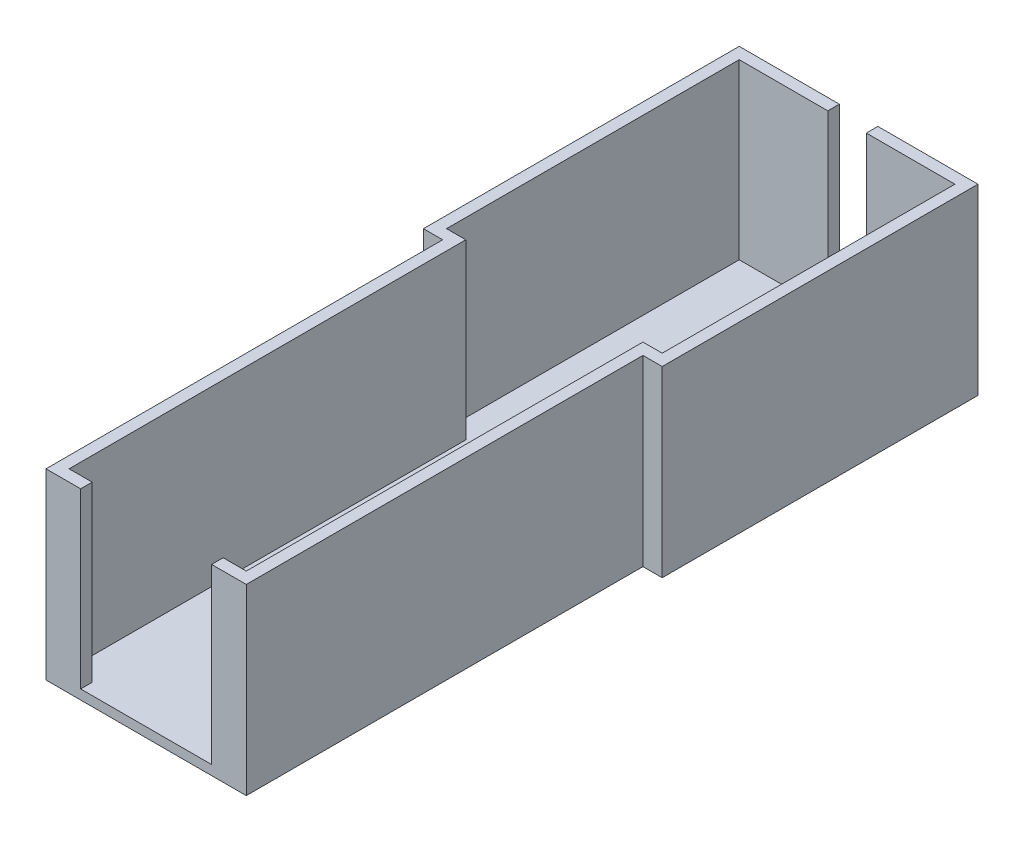
ISO-10303-21;
HEADER;
FILE_DESCRIPTION(('STEP AP214'),'2;1');
FILE_NAME('part.step','',(''),(''),'','','');
FILE_SCHEMA(('AUTOMOTIVE_DESIGN { 1 0 10303 214 1 1 1 1 }'));
ENDSEC;
DATA;
#1=APPLICATION_CONTEXT('core data for automotive mechanical design processes');
#2=APPLICATION_PROTOCOL_DEFINITION('international standard','automotive_design',2000,#1);
#3=PRODUCT_CONTEXT('',#1,'mechanical');
#4=PRODUCT('Part','Part','',(#3));
#5=PRODUCT_RELATED_PRODUCT_CATEGORY('part','',(#4));
#6=PRODUCT_DEFINITION_FORMATION('','',#4);
#7=PRODUCT_DEFINITION_CONTEXT('part definition',#1,'design');
#8=PRODUCT_DEFINITION('design','',#6,#7);
#9=PRODUCT_DEFINITION_SHAPE('','',#8);
#10=(LENGTH_UNIT() NAMED_UNIT(*) SI_UNIT(.MILLI.,.METRE.));
#11=(NAMED_UNIT(*) PLANE_ANGLE_UNIT() SI_UNIT($,.RADIAN.));
#12=(NAMED_UNIT(*) SI_UNIT($,.STERADIAN.) SOLID_ANGLE_UNIT());
#13=UNCERTAINTY_MEASURE_WITH_UNIT(LENGTH_MEASURE(1.E-05),#10,'distance_accuracy_value','');
#14=(GEOMETRIC_REPRESENTATION_CONTEXT(3) GLOBAL_UNCERTAINTY_ASSIGNED_CONTEXT((#13)) GLOBAL_UNIT_ASSIGNED_CONTEXT((#10,
#11,#12)) REPRESENTATION_CONTEXT('',''));
#15=CARTESIAN_POINT('',(0.,0.,0.));
#16=DIRECTION('',(0.,0.,1.));
#17=DIRECTION('',(1.,0.,0.));
#18=AXIS2_PLACEMENT_3D('',#15,#16,#17);
#19=CARTESIAN_POINT('',(0.,47.5,157.513513513514));
#20=DIRECTION('',(0.,0.,-1.));
#21=DIRECTION('',(-1.,0.,0.));
#22=AXIS2_PLACEMENT_3D('',#19,#20,#21);
#23=PLANE('',#22);
#24=DIRECTION('',(0.,1.,0.));
#25=VECTOR('',#24,1.);
#26=CARTESIAN_POINT('',(17.4054054054054,2.5,157.513513513514));
#27=LINE('',#26,#25);
#28=CARTESIAN_POINT('',(17.4054054054054,2.5,157.513513513514));
#29=VERTEX_POINT('',#28);
#30=CARTESIAN_POINT('',(17.4054054054054,47.5,157.513513513514));
#31=VERTEX_POINT('',#30);
#32=EDGE_CURVE('E462',#29,#31,#27,.T.);
#33=ORIENTED_EDGE('',*,*,#32,.T.);
#34=DIRECTION('',(1.,0.,0.));
#35=VECTOR('',#34,1.);
#36=CARTESIAN_POINT('',(0.,47.5,157.513513513514));
#37=LINE('',#36,#35);
#38=CARTESIAN_POINT('',(23.4054054054054,47.5,157.513513513514));
#39=VERTEX_POINT('',#38);
#40=EDGE_CURVE('E384',#31,#39,#37,.T.);
#41=ORIENTED_EDGE('',*,*,#40,.T.);
#42=DIRECTION('',(0.,-1.,0.));
#43=VECTOR('',#42,1.);
#44=CARTESIAN_POINT('',(23.4054054054054,47.5,157.513513513514));
#45=LINE('',#44,#43);
#46=CARTESIAN_POINT('',(23.4054054054054,2.5,157.513513513514));
#47=VERTEX_POINT('',#46);
#48=EDGE_CURVE('E271',#39,#47,#45,.T.);
#49=ORIENTED_EDGE('',*,*,#48,.T.);
#50=DIRECTION('',(1.,0.,0.));
#51=VECTOR('',#50,1.);
#52=CARTESIAN_POINT('',(0.,2.5,157.513513513514));
#53=LINE('',#52,#51);
#54=EDGE_CURVE('E413',#29,#47,#53,.T.);
#55=ORIENTED_EDGE('',*,*,#54,.F.);
#56=EDGE_LOOP('',(#33,#41,#49,#55));
#57=FACE_BOUND('',#56,.T.);
#58=ADVANCED_FACE('F41',(#57),#23,.T.);
#59=CARTESIAN_POINT('',(0.,47.5,-21.4864864864865));
#60=DIRECTION('',(0.,0.,-1.));
#61=DIRECTION('',(-1.,0.,0.));
#62=AXIS2_PLACEMENT_3D('',#59,#60,#61);
#63=PLANE('',#62);
#64=DIRECTION('',(1.,0.,0.));
#65=VECTOR('',#64,1.);
#66=CARTESIAN_POINT('',(0.,2.5,-21.4864864864865));
#67=LINE('',#66,#65);
#68=CARTESIAN_POINT('',(-27.5945945945946,2.5,-21.4864864864865));
#69=VERTEX_POINT('',#68);
#70=CARTESIAN_POINT('',(-4.59459459459459,2.5,-21.4864864864865));
#71=VERTEX_POINT('',#70);
#72=EDGE_CURVE('E227',#69,#71,#67,.T.);
#73=ORIENTED_EDGE('',*,*,#72,.T.);
#74=DIRECTION('',(0.,1.,0.));
#75=VECTOR('',#74,1.);
#76=CARTESIAN_POINT('',(-4.59459459459459,2.5,-21.4864864864865));
#77=LINE('',#76,#75);
#78=CARTESIAN_POINT('',(-4.59459459459459,47.5,-21.4864864864865));
#79=VERTEX_POINT('',#78);
#80=EDGE_CURVE('E220',#71,#79,#77,.T.);
#81=ORIENTED_EDGE('',*,*,#80,.T.);
#82=DIRECTION('',(1.,0.,0.));
#83=VECTOR('',#82,1.);
#84=CARTESIAN_POINT('',(0.,47.5,-21.4864864864865));
#85=LINE('',#84,#83);
#86=CARTESIAN_POINT('',(-27.5945945945946,47.5,-21.4864864864865));
#87=VERTEX_POINT('',#86);
#88=EDGE_CURVE('E400',#87,#79,#85,.T.);
#89=ORIENTED_EDGE('',*,*,#88,.F.);
#90=DIRECTION('',(0.,-1.,0.));
#91=VECTOR('',#90,1.);
#92=CARTESIAN_POINT('',(-27.5945945945946,47.5,-21.4864864864865));
#93=LINE('',#92,#91);
#94=EDGE_CURVE('E255',#87,#69,#93,.T.);
#95=ORIENTED_EDGE('',*,*,#94,.T.);
#96=EDGE_LOOP('',(#73,#81,#89,#95));
#97=FACE_BOUND('',#96,.T.);
#98=ADVANCED_FACE('F533',(#97),#63,.F.);
#99=CARTESIAN_POINT('',(0.,47.5,0.));
#100=DIRECTION('',(0.,1.,0.));
#101=DIRECTION('',(0.,0.,1.));
#102=AXIS2_PLACEMENT_3D('',#99,#100,#101);
#103=PLANE('',#102);
#104=DIRECTION('',(0.,0.,1.));
#105=VECTOR('',#104,1.);
#106=CARTESIAN_POINT('',(-4.59459459459459,47.5,-21.4864864864865));
#107=LINE('',#106,#105);
#108=CARTESIAN_POINT('',(-4.59459459459459,47.5,-24.4864864864865));
#109=VERTEX_POINT('',#108);
#110=EDGE_CURVE('E477',#109,#79,#107,.T.);
#111=ORIENTED_EDGE('',*,*,#110,.F.);
#112=DIRECTION('',(-1.,0.,0.));
#113=VECTOR('',#112,1.);
#114=CARTESIAN_POINT('',(0.,47.5,-24.4864864864865));
#115=LINE('',#114,#113);
#116=CARTESIAN_POINT('',(-30.5945945945946,47.5,-24.4864864864865));
#117=VERTEX_POINT('',#116);
#118=EDGE_CURVE('E354',#109,#117,#115,.T.);
#119=ORIENTED_EDGE('',*,*,#118,.T.);
#120=DIRECTION('',(0.,0.,1.));
#121=VECTOR('',#120,1.);
#122=CARTESIAN_POINT('',(-30.5945945945946,47.5,0.));
#123=LINE('',#122,#121);
#124=CARTESIAN_POINT('',(-30.5945945945946,47.5,57.5135135135135));
#125=VERTEX_POINT('',#124);
#126=EDGE_CURVE('E363',#117,#125,#123,.T.);
#127=ORIENTED_EDGE('',*,*,#126,.T.);
#128=DIRECTION('',(1.,0.,0.));
#129=VECTOR('',#128,1.);
#130=CARTESIAN_POINT('',(0.,47.5,57.5135135135135));
#131=LINE('',#130,#129);
#132=CARTESIAN_POINT('',(-25.5945945945946,47.5,57.5135135135135));
#133=VERTEX_POINT('',#132);
#134=EDGE_CURVE('E367',#125,#133,#131,.T.);
#135=ORIENTED_EDGE('',*,*,#134,.T.);
#136=DIRECTION('',(0.,0.,1.));
#137=VECTOR('',#136,1.);
#138=CARTESIAN_POINT('',(-25.5945945945946,47.5,0.));
#139=LINE('',#138,#137);
#140=CARTESIAN_POINT('',(-25.5945945945946,47.5,160.513513513514));
#141=VERTEX_POINT('',#140);
#142=EDGE_CURVE('E371',#133,#141,#139,.T.);
#143=ORIENTED_EDGE('',*,*,#142,.T.);
#144=DIRECTION('',(1.,0.,0.));
#145=VECTOR('',#144,1.);
#146=CARTESIAN_POINT('',(0.,47.5,160.513513513514));
#147=LINE('',#146,#145);
#148=CARTESIAN_POINT('',(-16.5945945945946,47.5,160.513513513514));
#149=VERTEX_POINT('',#148);
#150=EDGE_CURVE('E376',#141,#149,#147,.T.);
#151=ORIENTED_EDGE('',*,*,#150,.T.);
#152=DIRECTION('',(0.,0.,1.));
#153=VECTOR('',#152,1.);
#154=CARTESIAN_POINT('',(-16.5945945945946,47.5,160.513513513514));
#155=LINE('',#154,#153);
#156=CARTESIAN_POINT('',(-16.5945945945946,47.5,157.513513513514));
#157=VERTEX_POINT('',#156);
#158=EDGE_CURVE('E472',#157,#149,#155,.T.);
#159=ORIENTED_EDGE('',*,*,#158,.F.);
#160=CARTESIAN_POINT('',(-22.5945945945946,47.5,157.513513513514));
#161=VERTEX_POINT('',#160);
#162=EDGE_CURVE('E385',#161,#157,#37,.T.);
#163=ORIENTED_EDGE('',*,*,#162,.F.);
#164=DIRECTION('',(0.,0.,-1.));
#165=VECTOR('',#164,1.);
#166=CARTESIAN_POINT('',(-22.5945945945946,47.5,0.));
#167=LINE('',#166,#165);
#168=CARTESIAN_POINT('',(-22.5945945945946,47.5,54.5135135135135));
#169=VERTEX_POINT('',#168);
#170=EDGE_CURVE('E389',#161,#169,#167,.T.);
#171=ORIENTED_EDGE('',*,*,#170,.T.);
#172=DIRECTION('',(-1.,0.,0.));
#173=VECTOR('',#172,1.);
#174=CARTESIAN_POINT('',(0.,47.5,54.5135135135135));
#175=LINE('',#174,#173);
#176=CARTESIAN_POINT('',(-27.5945945945946,47.5,54.5135135135135));
#177=VERTEX_POINT('',#176);
#178=EDGE_CURVE('E393',#169,#177,#175,.T.);
#179=ORIENTED_EDGE('',*,*,#178,.T.);
#180=DIRECTION('',(0.,0.,1.));
#181=VECTOR('',#180,1.);
#182=CARTESIAN_POINT('',(-27.5945945945946,47.5,0.));
#183=LINE('',#182,#181);
#184=EDGE_CURVE('E396',#87,#177,#183,.T.);
#185=ORIENTED_EDGE('',*,*,#184,.F.);
#186=ORIENTED_EDGE('',*,*,#88,.T.);
#187=EDGE_LOOP('',(#111,#119,#127,#135,#143,#151,#159,#163,#171,#179,#185,#186));
#188=FACE_BOUND('',#187,.T.);
#189=ADVANCED_FACE('F435',(#188),#103,.T.);
#190=CARTESIAN_POINT('',(26.4054054054054,2.5,0.));
#191=DIRECTION('',(1.,0.,0.));
#192=DIRECTION('',(0.,0.,-1.));
#193=AXIS2_PLACEMENT_3D('',#190,#191,#192);
#194=PLANE('',#193);
#195=DIRECTION('',(0.,0.,1.));
#196=VECTOR('',#195,1.);
#197=CARTESIAN_POINT('',(26.4054054054054,0.,0.));
#198=LINE('',#197,#196);
#199=CARTESIAN_POINT('',(26.4054054054054,0.,57.5135135135135));
#200=VERTEX_POINT('',#199);
#201=CARTESIAN_POINT('',(26.4054054054054,0.,160.513513513514));
#202=VERTEX_POINT('',#201);
#203=EDGE_CURVE('E275',#200,#202,#198,.T.);
#204=ORIENTED_EDGE('',*,*,#203,.F.);
#205=DIRECTION('',(0.,-1.,0.));
#206=VECTOR('',#205,1.);
#207=CARTESIAN_POINT('',(26.4054054054054,2.5,57.5135135135135));
#208=LINE('',#207,#206);
#209=CARTESIAN_POINT('',(26.4054054054054,47.5,57.5135135135135));
#210=VERTEX_POINT('',#209);
#211=EDGE_CURVE('E11',#210,#200,#208,.T.);
#212=ORIENTED_EDGE('',*,*,#211,.F.);
#213=DIRECTION('',(0.,0.,-1.));
#214=VECTOR('',#213,1.);
#215=CARTESIAN_POINT('',(26.4054054054054,47.5,0.));
#216=LINE('',#215,#214);
#217=CARTESIAN_POINT('',(26.4054054054054,47.5,160.513513513514));
#218=VERTEX_POINT('',#217);
#219=EDGE_CURVE('E242',#218,#210,#216,.T.);
#220=ORIENTED_EDGE('',*,*,#219,.F.);
#221=DIRECTION('',(0.,-1.,0.));
#222=VECTOR('',#221,1.);
#223=CARTESIAN_POINT('',(26.4054054054054,2.5,160.513513513514));
#224=LINE('',#223,#222);
#225=EDGE_CURVE('E302',#218,#202,#224,.T.);
#226=ORIENTED_EDGE('',*,*,#225,.T.);
#227=EDGE_LOOP('',(#204,#212,#220,#226));
#228=FACE_BOUND('',#227,.T.);
#229=ADVANCED_FACE('F43',(#228),#194,.T.);
#230=CARTESIAN_POINT('',(0.,2.5,57.5135135135135));
#231=DIRECTION('',(0.,0.,-1.));
#232=DIRECTION('',(-1.,0.,0.));
#233=AXIS2_PLACEMENT_3D('',#230,#231,#232);
#234=PLANE('',#233);
#235=DIRECTION('',(1.,0.,0.));
#236=VECTOR('',#235,1.);
#237=CARTESIAN_POINT('',(0.,0.,57.5135135135135));
#238=LINE('',#237,#236);
#239=CARTESIAN_POINT('',(31.4054054054054,0.,57.5135135135135));
#240=VERTEX_POINT('',#239);
#241=EDGE_CURVE('E279',#200,#240,#238,.T.);
#242=ORIENTED_EDGE('',*,*,#241,.T.);
#243=DIRECTION('',(0.,-1.,0.));
#244=VECTOR('',#243,1.);
#245=CARTESIAN_POINT('',(31.4054054054054,2.5,57.5135135135135));
#246=LINE('',#245,#244);
#247=CARTESIAN_POINT('',(31.4054054054054,47.5,57.5135135135135));
#248=VERTEX_POINT('',#247);
#249=EDGE_CURVE('E50',#248,#240,#246,.T.);
#250=ORIENTED_EDGE('',*,*,#249,.F.);
#251=DIRECTION('',(1.,0.,0.));
#252=VECTOR('',#251,1.);
#253=CARTESIAN_POINT('',(0.,47.5,57.5135135135135));
#254=LINE('',#253,#252);
#255=EDGE_CURVE('E352',#210,#248,#254,.T.);
#256=ORIENTED_EDGE('',*,*,#255,.F.);
#257=ORIENTED_EDGE('',*,*,#211,.T.);
#258=EDGE_LOOP('',(#242,#250,#256,#257));
#259=FACE_BOUND('',#258,.T.);
#260=ADVANCED_FACE('F333',(#259),#234,.F.);
#261=CARTESIAN_POINT('',(31.4054054054054,2.5,0.));
#262=DIRECTION('',(1.,0.,0.));
#263=DIRECTION('',(0.,0.,-1.));
#264=AXIS2_PLACEMENT_3D('',#261,#262,#263);
#265=PLANE('',#264);
#266=DIRECTION('',(0.,0.,1.));
#267=VECTOR('',#266,1.);
#268=CARTESIAN_POINT('',(31.4054054054054,0.,0.));
#269=LINE('',#268,#267);
#270=CARTESIAN_POINT('',(31.4054054054054,0.,-24.4864864864865));
#271=VERTEX_POINT('',#270);
#272=EDGE_CURVE('E283',#271,#240,#269,.T.);
#273=ORIENTED_EDGE('',*,*,#272,.F.);
#274=DIRECTION('',(0.,-1.,0.));
#275=VECTOR('',#274,1.);
#276=CARTESIAN_POINT('',(31.4054054054054,2.5,-24.4864864864865));
#277=LINE('',#276,#275);
#278=CARTESIAN_POINT('',(31.4054054054054,47.5,-24.4864864864865));
#279=VERTEX_POINT('',#278);
#280=EDGE_CURVE('E320',#279,#271,#277,.T.);
#281=ORIENTED_EDGE('',*,*,#280,.F.);
#282=DIRECTION('',(0.,0.,-1.));
#283=VECTOR('',#282,1.);
#284=CARTESIAN_POINT('',(31.4054054054054,47.5,0.));
#285=LINE('',#284,#283);
#286=EDGE_CURVE('E328',#248,#279,#285,.T.);
#287=ORIENTED_EDGE('',*,*,#286,.F.);
#288=ORIENTED_EDGE('',*,*,#249,.T.);
#289=EDGE_LOOP('',(#273,#281,#287,#288));
#290=FACE_BOUND('',#289,.T.);
#291=ADVANCED_FACE('F326',(#290),#265,.T.);
#292=CARTESIAN_POINT('',(0.,2.5,-24.4864864864865));
#293=DIRECTION('',(0.,0.,-1.));
#294=DIRECTION('',(-1.,0.,0.));
#295=AXIS2_PLACEMENT_3D('',#292,#293,#294);
#296=PLANE('',#295);
#297=DIRECTION('',(0.,1.,0.));
#298=VECTOR('',#297,1.);
#299=CARTESIAN_POINT('',(-4.59459459459459,2.5,-24.4864864864865));
#300=LINE('',#299,#298);
#301=CARTESIAN_POINT('',(-4.59459459459459,2.5,-24.4864864864865));
#302=VERTEX_POINT('',#301);
#303=EDGE_CURVE('E414',#302,#109,#300,.T.);
#304=ORIENTED_EDGE('',*,*,#303,.F.);
#305=DIRECTION('',(-1.,0.,0.));
#306=VECTOR('',#305,1.);
#307=CARTESIAN_POINT('',(-4.59459459459459,2.5,-24.4864864864865));
#308=LINE('',#307,#306);
#309=CARTESIAN_POINT('',(5.40540540540541,2.5,-24.4864864864865));
#310=VERTEX_POINT('',#309);
#311=EDGE_CURVE('E210',#310,#302,#308,.T.);
#312=ORIENTED_EDGE('',*,*,#311,.F.);
#313=DIRECTION('',(0.,1.,0.));
#314=VECTOR('',#313,1.);
#315=CARTESIAN_POINT('',(5.40540540540541,2.5,-24.4864864864865));
#316=LINE('',#315,#314);
#317=CARTESIAN_POINT('',(5.40540540540541,47.5,-24.4864864864865));
#318=VERTEX_POINT('',#317);
#319=EDGE_CURVE('E206',#310,#318,#316,.T.);
#320=ORIENTED_EDGE('',*,*,#319,.T.);
#321=EDGE_CURVE('E348',#279,#318,#115,.T.);
#322=ORIENTED_EDGE('',*,*,#321,.F.);
#323=ORIENTED_EDGE('',*,*,#280,.T.);
#324=DIRECTION('',(1.,0.,0.));
#325=VECTOR('',#324,1.);
#326=CARTESIAN_POINT('',(0.,0.,-24.4864864864865));
#327=LINE('',#326,#325);
#328=CARTESIAN_POINT('',(-30.5945945945946,0.,-24.4864864864865));
#329=VERTEX_POINT('',#328);
#330=EDGE_CURVE('E288',#329,#271,#327,.T.);
#331=ORIENTED_EDGE('',*,*,#330,.F.);
#332=DIRECTION('',(0.,-1.,0.));
#333=VECTOR('',#332,1.);
#334=CARTESIAN_POINT('',(-30.5945945945946,2.5,-24.4864864864865));
#335=LINE('',#334,#333);
#336=EDGE_CURVE('E317',#117,#329,#335,.T.);
#337=ORIENTED_EDGE('',*,*,#336,.F.);
#338=ORIENTED_EDGE('',*,*,#118,.F.);
#339=EDGE_LOOP('',(#304,#312,#320,#322,#323,#331,#337,#338));
#340=FACE_BOUND('',#339,.T.);
#341=ADVANCED_FACE('F343',(#340),#296,.T.);
#342=CARTESIAN_POINT('',(-30.5945945945946,2.5,0.));
#343=DIRECTION('',(1.,0.,0.));
#344=DIRECTION('',(0.,0.,-1.));
#345=AXIS2_PLACEMENT_3D('',#342,#343,#344);
#346=PLANE('',#345);
#347=DIRECTION('',(0.,0.,1.));
#348=VECTOR('',#347,1.);
#349=CARTESIAN_POINT('',(-30.5945945945946,0.,0.));
#350=LINE('',#349,#348);
#351=CARTESIAN_POINT('',(-30.5945945945946,0.,57.5135135135135));
#352=VERTEX_POINT('',#351);
#353=EDGE_CURVE('E292',#329,#352,#350,.T.);
#354=ORIENTED_EDGE('',*,*,#353,.T.);
#355=DIRECTION('',(0.,-1.,0.));
#356=VECTOR('',#355,1.);
#357=CARTESIAN_POINT('',(-30.5945945945946,2.5,57.5135135135135));
#358=LINE('',#357,#356);
#359=EDGE_CURVE('E313',#125,#352,#358,.T.);
#360=ORIENTED_EDGE('',*,*,#359,.F.);
#361=ORIENTED_EDGE('',*,*,#126,.F.);
#362=ORIENTED_EDGE('',*,*,#336,.T.);
#363=EDGE_LOOP('',(#354,#360,#361,#362));
#364=FACE_BOUND('',#363,.T.);
#365=ADVANCED_FACE('F572',(#364),#346,.F.);
#366=CARTESIAN_POINT('',(-25.5945945945946,0.,57.5135135135135));
#367=VERTEX_POINT('',#366);
#368=EDGE_CURVE('E284',#352,#367,#238,.T.);
#369=ORIENTED_EDGE('',*,*,#368,.T.);
#370=DIRECTION('',(0.,-1.,0.));
#371=VECTOR('',#370,1.);
#372=CARTESIAN_POINT('',(-25.5945945945946,2.5,57.5135135135135));
#373=LINE('',#372,#371);
#374=EDGE_CURVE('E309',#133,#367,#373,.T.);
#375=ORIENTED_EDGE('',*,*,#374,.F.);
#376=ORIENTED_EDGE('',*,*,#134,.F.);
#377=ORIENTED_EDGE('',*,*,#359,.T.);
#378=EDGE_LOOP('',(#369,#375,#376,#377));
#379=FACE_BOUND('',#378,.T.);
#380=ADVANCED_FACE('F493',(#379),#234,.F.);
#381=CARTESIAN_POINT('',(-25.5945945945946,2.5,0.));
#382=DIRECTION('',(1.,0.,0.));
#383=DIRECTION('',(0.,0.,-1.));
#384=AXIS2_PLACEMENT_3D('',#381,#382,#383);
#385=PLANE('',#384);
#386=DIRECTION('',(0.,0.,1.));
#387=VECTOR('',#386,1.);
#388=CARTESIAN_POINT('',(-25.5945945945946,0.,0.));
#389=LINE('',#388,#387);
#390=CARTESIAN_POINT('',(-25.5945945945946,0.,160.513513513514));
#391=VERTEX_POINT('',#390);
#392=EDGE_CURVE('E295',#367,#391,#389,.T.);
#393=ORIENTED_EDGE('',*,*,#392,.T.);
#394=DIRECTION('',(0.,-1.,0.));
#395=VECTOR('',#394,1.);
#396=CARTESIAN_POINT('',(-25.5945945945946,2.5,160.513513513514));
#397=LINE('',#396,#395);
#398=EDGE_CURVE('E305',#141,#391,#397,.T.);
#399=ORIENTED_EDGE('',*,*,#398,.F.);
#400=ORIENTED_EDGE('',*,*,#142,.F.);
#401=ORIENTED_EDGE('',*,*,#374,.T.);
#402=EDGE_LOOP('',(#393,#399,#400,#401));
#403=FACE_BOUND('',#402,.T.);
#404=ADVANCED_FACE('F490',(#403),#385,.F.);
#405=CARTESIAN_POINT('',(0.,2.5,160.513513513514));
#406=DIRECTION('',(0.,0.,-1.));
#407=DIRECTION('',(-1.,0.,0.));
#408=AXIS2_PLACEMENT_3D('',#405,#406,#407);
#409=PLANE('',#408);
#410=CARTESIAN_POINT('',(17.4054054054054,47.5,160.513513513514));
#411=VERTEX_POINT('',#410);
#412=EDGE_CURVE('E375',#411,#218,#147,.T.);
#413=ORIENTED_EDGE('',*,*,#412,.F.);
#414=DIRECTION('',(0.,1.,0.));
#415=VECTOR('',#414,1.);
#416=CARTESIAN_POINT('',(17.4054054054054,2.5,160.513513513514));
#417=LINE('',#416,#415);
#418=CARTESIAN_POINT('',(17.4054054054054,2.5,160.513513513514));
#419=VERTEX_POINT('',#418);
#420=EDGE_CURVE('E460',#419,#411,#417,.T.);
#421=ORIENTED_EDGE('',*,*,#420,.F.);
#422=DIRECTION('',(1.,0.,0.));
#423=VECTOR('',#422,1.);
#424=CARTESIAN_POINT('',(17.4054054054054,2.5,160.513513513514));
#425=LINE('',#424,#423);
#426=CARTESIAN_POINT('',(-16.5945945945946,2.5,160.513513513514));
#427=VERTEX_POINT('',#426);
#428=EDGE_CURVE('E449',#427,#419,#425,.T.);
#429=ORIENTED_EDGE('',*,*,#428,.F.);
#430=DIRECTION('',(0.,1.,0.));
#431=VECTOR('',#430,1.);
#432=CARTESIAN_POINT('',(-16.5945945945946,2.5,160.513513513514));
#433=LINE('',#432,#431);
#434=EDGE_CURVE('E459',#427,#149,#433,.T.);
#435=ORIENTED_EDGE('',*,*,#434,.T.);
#436=ORIENTED_EDGE('',*,*,#150,.F.);
#437=ORIENTED_EDGE('',*,*,#398,.T.);
#438=DIRECTION('',(1.,0.,0.));
#439=VECTOR('',#438,1.);
#440=CARTESIAN_POINT('',(0.,0.,160.513513513514));
#441=LINE('',#440,#439);
#442=EDGE_CURVE('E298',#391,#202,#441,.T.);
#443=ORIENTED_EDGE('',*,*,#442,.T.);
#444=ORIENTED_EDGE('',*,*,#225,.F.);
#445=EDGE_LOOP('',(#413,#421,#429,#435,#436,#437,#443,#444));
#446=FACE_BOUND('',#445,.T.);
#447=ADVANCED_FACE('F457',(#446),#409,.F.);
#448=CARTESIAN_POINT('',(0.,0.,0.));
#449=DIRECTION('',(0.,1.,0.));
#450=DIRECTION('',(0.,0.,1.));
#451=AXIS2_PLACEMENT_3D('',#448,#449,#450);
#452=PLANE('',#451);
#453=ORIENTED_EDGE('',*,*,#203,.T.);
#454=ORIENTED_EDGE('',*,*,#442,.F.);
#455=ORIENTED_EDGE('',*,*,#392,.F.);
#456=ORIENTED_EDGE('',*,*,#368,.F.);
#457=ORIENTED_EDGE('',*,*,#353,.F.);
#458=ORIENTED_EDGE('',*,*,#330,.T.);
#459=ORIENTED_EDGE('',*,*,#272,.T.);
#460=ORIENTED_EDGE('',*,*,#241,.F.);
#461=EDGE_LOOP('',(#453,#454,#455,#456,#457,#458,#459,#460));
#462=FACE_BOUND('',#461,.T.);
#463=ADVANCED_FACE('F336',(#462),#452,.F.);
#464=CARTESIAN_POINT('',(23.4054054054054,47.5,0.));
#465=DIRECTION('',(-1.,0.,0.));
#466=DIRECTION('',(0.,0.,1.));
#467=AXIS2_PLACEMENT_3D('',#464,#465,#466);
#468=PLANE('',#467);
#469=DIRECTION('',(0.,0.,-1.));
#470=VECTOR('',#469,1.);
#471=CARTESIAN_POINT('',(23.4054054054054,2.5,0.));
#472=LINE('',#471,#470);
#473=CARTESIAN_POINT('',(23.4054054054054,2.5,54.5135135135135));
#474=VERTEX_POINT('',#473);
#475=EDGE_CURVE('E410',#47,#474,#472,.T.);
#476=ORIENTED_EDGE('',*,*,#475,.F.);
#477=ORIENTED_EDGE('',*,*,#48,.F.);
#478=DIRECTION('',(0.,0.,-1.));
#479=VECTOR('',#478,1.);
#480=CARTESIAN_POINT('',(23.4054054054054,47.5,0.));
#481=LINE('',#480,#479);
#482=CARTESIAN_POINT('',(23.4054054054054,47.5,54.5135135135135));
#483=VERTEX_POINT('',#482);
#484=EDGE_CURVE('E380',#39,#483,#481,.T.);
#485=ORIENTED_EDGE('',*,*,#484,.T.);
#486=DIRECTION('',(0.,-1.,0.));
#487=VECTOR('',#486,1.);
#488=CARTESIAN_POINT('',(23.4054054054054,47.5,54.5135135135135));
#489=LINE('',#488,#487);
#490=EDGE_CURVE('E243',#483,#474,#489,.T.);
#491=ORIENTED_EDGE('',*,*,#490,.T.);
#492=EDGE_LOOP('',(#476,#477,#485,#491));
#493=FACE_BOUND('',#492,.T.);
#494=ADVANCED_FACE('F505',(#493),#468,.T.);
#495=DIRECTION('',(0.,1.,0.));
#496=VECTOR('',#495,1.);
#497=CARTESIAN_POINT('',(-16.5945945945946,2.5,157.513513513514));
#498=LINE('',#497,#496);
#499=CARTESIAN_POINT('',(-16.5945945945946,2.5,157.513513513514));
#500=VERTEX_POINT('',#499);
#501=EDGE_CURVE('E445',#500,#157,#498,.T.);
#502=ORIENTED_EDGE('',*,*,#501,.F.);
#503=CARTESIAN_POINT('',(-22.5945945945946,2.5,157.513513513514));
#504=VERTEX_POINT('',#503);
#505=EDGE_CURVE('E415',#504,#500,#53,.T.);
#506=ORIENTED_EDGE('',*,*,#505,.F.);
#507=DIRECTION('',(0.,-1.,0.));
#508=VECTOR('',#507,1.);
#509=CARTESIAN_POINT('',(-22.5945945945946,47.5,157.513513513514));
#510=LINE('',#509,#508);
#511=EDGE_CURVE('E267',#161,#504,#510,.T.);
#512=ORIENTED_EDGE('',*,*,#511,.F.);
#513=ORIENTED_EDGE('',*,*,#162,.T.);
#514=EDGE_LOOP('',(#502,#506,#512,#513));
#515=FACE_BOUND('',#514,.T.);
#516=ADVANCED_FACE('F444',(#515),#23,.T.);
#517=CARTESIAN_POINT('',(-22.5945945945946,47.5,0.));
#518=DIRECTION('',(-1.,0.,0.));
#519=DIRECTION('',(0.,0.,1.));
#520=AXIS2_PLACEMENT_3D('',#517,#518,#519);
#521=PLANE('',#520);
#522=DIRECTION('',(0.,0.,-1.));
#523=VECTOR('',#522,1.);
#524=CARTESIAN_POINT('',(-22.5945945945946,2.5,0.));
#525=LINE('',#524,#523);
#526=CARTESIAN_POINT('',(-22.5945945945946,2.5,54.5135135135135));
#527=VERTEX_POINT('',#526);
#528=EDGE_CURVE('E419',#504,#527,#525,.T.);
#529=ORIENTED_EDGE('',*,*,#528,.T.);
#530=DIRECTION('',(0.,-1.,0.));
#531=VECTOR('',#530,1.);
#532=CARTESIAN_POINT('',(-22.5945945945946,47.5,54.5135135135135));
#533=LINE('',#532,#531);
#534=EDGE_CURVE('E263',#169,#527,#533,.T.);
#535=ORIENTED_EDGE('',*,*,#534,.F.);
#536=ORIENTED_EDGE('',*,*,#170,.F.);
#537=ORIENTED_EDGE('',*,*,#511,.T.);
#538=EDGE_LOOP('',(#529,#535,#536,#537));
#539=FACE_BOUND('',#538,.T.);
#540=ADVANCED_FACE('F440',(#539),#521,.F.);
#541=CARTESIAN_POINT('',(0.,47.5,54.5135135135135));
#542=DIRECTION('',(0.,0.,1.));
#543=DIRECTION('',(1.,0.,0.));
#544=AXIS2_PLACEMENT_3D('',#541,#542,#543);
#545=PLANE('',#544);
#546=DIRECTION('',(-1.,0.,0.));
#547=VECTOR('',#546,1.);
#548=CARTESIAN_POINT('',(0.,2.5,54.5135135135135));
#549=LINE('',#548,#547);
#550=CARTESIAN_POINT('',(-27.5945945945946,2.5,54.5135135135135));
#551=VERTEX_POINT('',#550);
#552=EDGE_CURVE('E233',#527,#551,#549,.T.);
#553=ORIENTED_EDGE('',*,*,#552,.T.);
#554=DIRECTION('',(0.,-1.,0.));
#555=VECTOR('',#554,1.);
#556=CARTESIAN_POINT('',(-27.5945945945946,47.5,54.5135135135135));
#557=LINE('',#556,#555);
#558=EDGE_CURVE('E259',#177,#551,#557,.T.);
#559=ORIENTED_EDGE('',*,*,#558,.F.);
#560=ORIENTED_EDGE('',*,*,#178,.F.);
#561=ORIENTED_EDGE('',*,*,#534,.T.);
#562=EDGE_LOOP('',(#553,#559,#560,#561));
#563=FACE_BOUND('',#562,.T.);
#564=ADVANCED_FACE('F426',(#563),#545,.F.);
#565=CARTESIAN_POINT('',(-27.5945945945946,47.5,0.));
#566=DIRECTION('',(1.,0.,0.));
#567=DIRECTION('',(0.,0.,-1.));
#568=AXIS2_PLACEMENT_3D('',#565,#566,#567);
#569=PLANE('',#568);
#570=DIRECTION('',(0.,0.,1.));
#571=VECTOR('',#570,1.);
#572=CARTESIAN_POINT('',(-27.5945945945946,2.5,0.));
#573=LINE('',#572,#571);
#574=EDGE_CURVE('E228',#69,#551,#573,.T.);
#575=ORIENTED_EDGE('',*,*,#574,.F.);
#576=ORIENTED_EDGE('',*,*,#94,.F.);
#577=ORIENTED_EDGE('',*,*,#184,.T.);
#578=ORIENTED_EDGE('',*,*,#558,.T.);
#579=EDGE_LOOP('',(#575,#576,#577,#578));
#580=FACE_BOUND('',#579,.T.);
#581=ADVANCED_FACE('F430',(#580),#569,.T.);
#582=CARTESIAN_POINT('',(5.40540540540541,47.5,-21.4864864864865));
#583=VERTEX_POINT('',#582);
#584=CARTESIAN_POINT('',(28.4054054054054,47.5,-21.4864864864865));
#585=VERTEX_POINT('',#584);
#586=EDGE_CURVE('E218',#583,#585,#85,.T.);
#587=ORIENTED_EDGE('',*,*,#586,.F.);
#588=DIRECTION('',(0.,1.,0.));
#589=VECTOR('',#588,1.);
#590=CARTESIAN_POINT('',(5.40540540540541,2.5,-21.4864864864865));
#591=LINE('',#590,#589);
#592=CARTESIAN_POINT('',(5.40540540540541,2.5,-21.4864864864865));
#593=VERTEX_POINT('',#592);
#594=EDGE_CURVE('E203',#593,#583,#591,.T.);
#595=ORIENTED_EDGE('',*,*,#594,.F.);
#596=CARTESIAN_POINT('',(28.4054054054054,2.5,-21.4864864864865));
#597=VERTEX_POINT('',#596);
#598=EDGE_CURVE('E216',#593,#597,#67,.T.);
#599=ORIENTED_EDGE('',*,*,#598,.T.);
#600=DIRECTION('',(0.,-1.,0.));
#601=VECTOR('',#600,1.);
#602=CARTESIAN_POINT('',(28.4054054054054,47.5,-21.4864864864865));
#603=LINE('',#602,#601);
#604=EDGE_CURVE('E252',#585,#597,#603,.T.);
#605=ORIENTED_EDGE('',*,*,#604,.F.);
#606=EDGE_LOOP('',(#587,#595,#599,#605));
#607=FACE_BOUND('',#606,.T.);
#608=ADVANCED_FACE('F214',(#607),#63,.F.);
#609=CARTESIAN_POINT('',(28.4054054054054,47.5,0.));
#610=DIRECTION('',(1.,0.,0.));
#611=DIRECTION('',(0.,0.,-1.));
#612=AXIS2_PLACEMENT_3D('',#609,#610,#611);
#613=PLANE('',#612);
#614=DIRECTION('',(0.,0.,1.));
#615=VECTOR('',#614,1.);
#616=CARTESIAN_POINT('',(28.4054054054054,2.5,0.));
#617=LINE('',#616,#615);
#618=CARTESIAN_POINT('',(28.4054054054054,2.5,54.5135135135135));
#619=VERTEX_POINT('',#618);
#620=EDGE_CURVE('E224',#597,#619,#617,.T.);
#621=ORIENTED_EDGE('',*,*,#620,.T.);
#622=DIRECTION('',(0.,-1.,0.));
#623=VECTOR('',#622,1.);
#624=CARTESIAN_POINT('',(28.4054054054054,47.5,54.5135135135135));
#625=LINE('',#624,#623);
#626=CARTESIAN_POINT('',(28.4054054054054,47.5,54.5135135135135));
#627=VERTEX_POINT('',#626);
#628=EDGE_CURVE('E247',#627,#619,#625,.T.);
#629=ORIENTED_EDGE('',*,*,#628,.F.);
#630=DIRECTION('',(0.,0.,1.));
#631=VECTOR('',#630,1.);
#632=CARTESIAN_POINT('',(28.4054054054054,47.5,0.));
#633=LINE('',#632,#631);
#634=EDGE_CURVE('E404',#585,#627,#633,.T.);
#635=ORIENTED_EDGE('',*,*,#634,.F.);
#636=ORIENTED_EDGE('',*,*,#604,.T.);
#637=EDGE_LOOP('',(#621,#629,#635,#636));
#638=FACE_BOUND('',#637,.T.);
#639=ADVANCED_FACE('F545',(#638),#613,.F.);
#640=CARTESIAN_POINT('',(0.,47.5,54.5135135135136));
#641=DIRECTION('',(0.,0.,-1.));
#642=DIRECTION('',(-1.,0.,0.));
#643=AXIS2_PLACEMENT_3D('',#640,#641,#642);
#644=PLANE('',#643);
#645=DIRECTION('',(1.,0.,0.));
#646=VECTOR('',#645,1.);
#647=CARTESIAN_POINT('',(0.,2.5,54.5135135135136));
#648=LINE('',#647,#646);
#649=EDGE_CURVE('E239',#474,#619,#648,.T.);
#650=ORIENTED_EDGE('',*,*,#649,.F.);
#651=ORIENTED_EDGE('',*,*,#490,.F.);
#652=DIRECTION('',(1.,0.,0.));
#653=VECTOR('',#652,1.);
#654=CARTESIAN_POINT('',(0.,47.5,54.5135135135136));
#655=LINE('',#654,#653);
#656=EDGE_CURVE('E248',#483,#627,#655,.T.);
#657=ORIENTED_EDGE('',*,*,#656,.T.);
#658=ORIENTED_EDGE('',*,*,#628,.T.);
#659=EDGE_LOOP('',(#650,#651,#657,#658));
#660=FACE_BOUND('',#659,.T.);
#661=ADVANCED_FACE('F511',(#660),#644,.T.);
#662=DIRECTION('',(0.,0.,-1.));
#663=VECTOR('',#662,1.);
#664=CARTESIAN_POINT('',(5.40540540540541,47.5,-21.4864864864865));
#665=LINE('',#664,#663);
#666=EDGE_CURVE('E524',#583,#318,#665,.T.);
#667=ORIENTED_EDGE('',*,*,#666,.F.);
#668=ORIENTED_EDGE('',*,*,#586,.T.);
#669=ORIENTED_EDGE('',*,*,#634,.T.);
#670=ORIENTED_EDGE('',*,*,#656,.F.);
#671=ORIENTED_EDGE('',*,*,#484,.F.);
#672=ORIENTED_EDGE('',*,*,#40,.F.);
#673=DIRECTION('',(0.,0.,-1.));
#674=VECTOR('',#673,1.);
#675=CARTESIAN_POINT('',(17.4054054054054,47.5,160.513513513514));
#676=LINE('',#675,#674);
#677=EDGE_CURVE('E469',#411,#31,#676,.T.);
#678=ORIENTED_EDGE('',*,*,#677,.F.);
#679=ORIENTED_EDGE('',*,*,#412,.T.);
#680=ORIENTED_EDGE('',*,*,#219,.T.);
#681=ORIENTED_EDGE('',*,*,#255,.T.);
#682=ORIENTED_EDGE('',*,*,#286,.T.);
#683=ORIENTED_EDGE('',*,*,#321,.T.);
#684=EDGE_LOOP('',(#667,#668,#669,#670,#671,#672,#678,#679,#680,#681,#682,#683));
#685=FACE_BOUND('',#684,.T.);
#686=ADVANCED_FACE('F350',(#685),#103,.T.);
#687=CARTESIAN_POINT('',(0.,2.5,0.));
#688=DIRECTION('',(0.,1.,0.));
#689=DIRECTION('',(0.,0.,1.));
#690=AXIS2_PLACEMENT_3D('',#687,#688,#689);
#691=PLANE('',#690);
#692=ORIENTED_EDGE('',*,*,#475,.T.);
#693=ORIENTED_EDGE('',*,*,#649,.T.);
#694=ORIENTED_EDGE('',*,*,#620,.F.);
#695=ORIENTED_EDGE('',*,*,#598,.F.);
#696=DIRECTION('',(0.,0.,-1.));
#697=VECTOR('',#696,1.);
#698=CARTESIAN_POINT('',(5.40540540540541,2.5,-21.4864864864865));
#699=LINE('',#698,#697);
#700=EDGE_CURVE('E200',#593,#310,#699,.T.);
#701=ORIENTED_EDGE('',*,*,#700,.T.);
#702=ORIENTED_EDGE('',*,*,#311,.T.);
#703=DIRECTION('',(0.,0.,1.));
#704=VECTOR('',#703,1.);
#705=CARTESIAN_POINT('',(-4.59459459459459,2.5,-21.4864864864865));
#706=LINE('',#705,#704);
#707=EDGE_CURVE('E64',#302,#71,#706,.T.);
#708=ORIENTED_EDGE('',*,*,#707,.T.);
#709=ORIENTED_EDGE('',*,*,#72,.F.);
#710=ORIENTED_EDGE('',*,*,#574,.T.);
#711=ORIENTED_EDGE('',*,*,#552,.F.);
#712=ORIENTED_EDGE('',*,*,#528,.F.);
#713=ORIENTED_EDGE('',*,*,#505,.T.);
#714=DIRECTION('',(0.,0.,1.));
#715=VECTOR('',#714,1.);
#716=CARTESIAN_POINT('',(-16.5945945945946,2.5,160.513513513514));
#717=LINE('',#716,#715);
#718=EDGE_CURVE('E447',#500,#427,#717,.T.);
#719=ORIENTED_EDGE('',*,*,#718,.T.);
#720=ORIENTED_EDGE('',*,*,#428,.T.);
#721=DIRECTION('',(0.,0.,-1.));
#722=VECTOR('',#721,1.);
#723=CARTESIAN_POINT('',(17.4054054054054,2.5,160.513513513514));
#724=LINE('',#723,#722);
#725=EDGE_CURVE('E57',#419,#29,#724,.T.);
#726=ORIENTED_EDGE('',*,*,#725,.T.);
#727=ORIENTED_EDGE('',*,*,#54,.T.);
#728=EDGE_LOOP('',(#692,#693,#694,#695,#701,#702,#708,#709,#710,#711,#712,#713,#719,#720,#726,#727));
#729=FACE_BOUND('',#728,.T.);
#730=ADVANCED_FACE('F222',(#729),#691,.T.);
#731=CARTESIAN_POINT('',(17.4054054054054,2.5,160.513513513514));
#732=DIRECTION('',(1.,0.,0.));
#733=DIRECTION('',(0.,0.,-1.));
#734=AXIS2_PLACEMENT_3D('',#731,#732,#733);
#735=PLANE('',#734);
#736=ORIENTED_EDGE('',*,*,#677,.T.);
#737=ORIENTED_EDGE('',*,*,#32,.F.);
#738=ORIENTED_EDGE('',*,*,#725,.F.);
#739=ORIENTED_EDGE('',*,*,#420,.T.);
#740=EDGE_LOOP('',(#736,#737,#738,#739));
#741=FACE_BOUND('',#740,.T.);
#742=ADVANCED_FACE('F563',(#741),#735,.F.);
#743=CARTESIAN_POINT('',(-16.5945945945946,2.5,160.513513513514));
#744=DIRECTION('',(-1.,0.,0.));
#745=DIRECTION('',(0.,0.,1.));
#746=AXIS2_PLACEMENT_3D('',#743,#744,#745);
#747=PLANE('',#746);
#748=ORIENTED_EDGE('',*,*,#158,.T.);
#749=ORIENTED_EDGE('',*,*,#434,.F.);
#750=ORIENTED_EDGE('',*,*,#718,.F.);
#751=ORIENTED_EDGE('',*,*,#501,.T.);
#752=EDGE_LOOP('',(#748,#749,#750,#751));
#753=FACE_BOUND('',#752,.T.);
#754=ADVANCED_FACE('F652',(#753),#747,.F.);
#755=CARTESIAN_POINT('',(-4.59459459459459,2.5,-21.4864864864865));
#756=DIRECTION('',(-1.,0.,0.));
#757=DIRECTION('',(0.,0.,1.));
#758=AXIS2_PLACEMENT_3D('',#755,#756,#757);
#759=PLANE('',#758);
#760=ORIENTED_EDGE('',*,*,#110,.T.);
#761=ORIENTED_EDGE('',*,*,#80,.F.);
#762=ORIENTED_EDGE('',*,*,#707,.F.);
#763=ORIENTED_EDGE('',*,*,#303,.T.);
#764=EDGE_LOOP('',(#760,#761,#762,#763));
#765=FACE_BOUND('',#764,.T.);
#766=ADVANCED_FACE('F531',(#765),#759,.F.);
#767=CARTESIAN_POINT('',(5.40540540540541,2.5,-21.4864864864865));
#768=DIRECTION('',(1.,0.,0.));
#769=DIRECTION('',(0.,0.,-1.));
#770=AXIS2_PLACEMENT_3D('',#767,#768,#769);
#771=PLANE('',#770);
#772=ORIENTED_EDGE('',*,*,#666,.T.);
#773=ORIENTED_EDGE('',*,*,#319,.F.);
#774=ORIENTED_EDGE('',*,*,#700,.F.);
#775=ORIENTED_EDGE('',*,*,#594,.T.);
#776=EDGE_LOOP('',(#772,#773,#774,#775));
#777=FACE_BOUND('',#776,.T.);
#778=ADVANCED_FACE('F202',(#777),#771,.F.);
#779=CLOSED_SHELL('',(#58,#98,#189,#229,#260,#291,#341,#365,#380,#404,#447,#463,#494,#516,#540,
#564,#581,#608,#639,#661,#686,#730,#742,#754,#766,#778));
#780=MANIFOLD_SOLID_BREP('B2',#779);
#781=ADVANCED_BREP_SHAPE_REPRESENTATION('',(#18,#780),#14);
#782=SHAPE_DEFINITION_REPRESENTATION(#9,#781);
ENDSEC;
END-ISO-10303-21;
